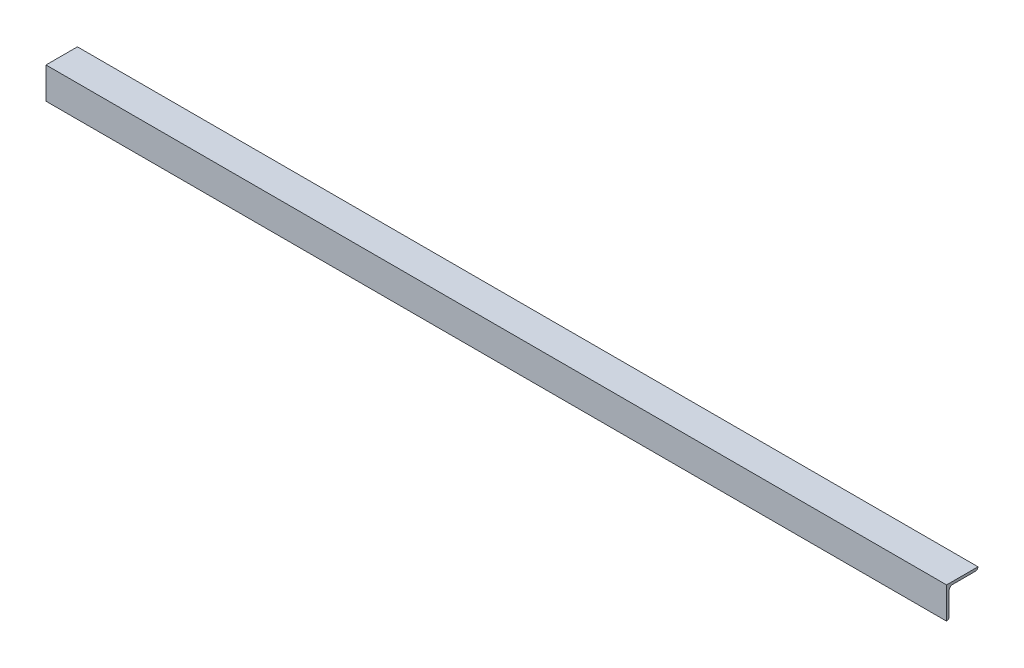
ISO-10303-21;
HEADER;
FILE_DESCRIPTION(('STEP AP214'),'2;1');
FILE_NAME('part.step','',(''),(''),'','','');
FILE_SCHEMA(('AUTOMOTIVE_DESIGN { 1 0 10303 214 1 1 1 1 }'));
ENDSEC;
DATA;
#1=APPLICATION_CONTEXT('core data for automotive mechanical design processes');
#2=APPLICATION_PROTOCOL_DEFINITION('international standard','automotive_design',2000,#1);
#3=PRODUCT_CONTEXT('',#1,'mechanical');
#4=PRODUCT('Part','Part','',(#3));
#5=PRODUCT_RELATED_PRODUCT_CATEGORY('part','',(#4));
#6=PRODUCT_DEFINITION_FORMATION('','',#4);
#7=PRODUCT_DEFINITION_CONTEXT('part definition',#1,'design');
#8=PRODUCT_DEFINITION('design','',#6,#7);
#9=PRODUCT_DEFINITION_SHAPE('','',#8);
#10=(LENGTH_UNIT() NAMED_UNIT(*) SI_UNIT(.MILLI.,.METRE.));
#11=(NAMED_UNIT(*) PLANE_ANGLE_UNIT() SI_UNIT($,.RADIAN.));
#12=(NAMED_UNIT(*) SI_UNIT($,.STERADIAN.) SOLID_ANGLE_UNIT());
#13=UNCERTAINTY_MEASURE_WITH_UNIT(LENGTH_MEASURE(1.E-05),#10,'distance_accuracy_value','');
#14=(GEOMETRIC_REPRESENTATION_CONTEXT(3) GLOBAL_UNCERTAINTY_ASSIGNED_CONTEXT((#13)) GLOBAL_UNIT_ASSIGNED_CONTEXT((#10,
#11,#12)) REPRESENTATION_CONTEXT('',''));
#15=CARTESIAN_POINT('',(0.,0.,0.));
#16=DIRECTION('',(0.,0.,1.));
#17=DIRECTION('',(1.,0.,0.));
#18=AXIS2_PLACEMENT_3D('',#15,#16,#17);
#19=CARTESIAN_POINT('',(-3939.78384,-14.2875,-14.2875));
#20=DIRECTION('',(1.,0.,0.));
#21=DIRECTION('',(0.,0.,-1.));
#22=AXIS2_PLACEMENT_3D('',#19,#20,#21);
#23=CYLINDRICAL_SURFACE('',#22,7.9375);
#24=DIRECTION('',(-1.,0.,0.));
#25=VECTOR('',#24,1.);
#26=CARTESIAN_POINT('',(-1092.2,-14.2875,-6.35));
#27=LINE('',#26,#25);
#28=CARTESIAN_POINT('',(-1092.2,-14.2875,-6.35));
#29=VERTEX_POINT('',#28);
#30=CARTESIAN_POINT('',(1092.2,-14.2875,-6.35));
#31=VERTEX_POINT('',#30);
#32=EDGE_CURVE('E83',#29,#31,#27,.F.);
#33=ORIENTED_EDGE('',*,*,#32,.F.);
#34=CARTESIAN_POINT('',(-1092.2,-14.2875,-14.2875));
#35=DIRECTION('',(1.,0.,0.));
#36=DIRECTION('',(0.,0.,-1.));
#37=AXIS2_PLACEMENT_3D('',#34,#35,#36);
#38=CIRCLE('',#37,7.9375);
#39=CARTESIAN_POINT('',(-1092.2,-6.35,-14.2875));
#40=VERTEX_POINT('',#39);
#41=EDGE_CURVE('E122',#29,#40,#38,.F.);
#42=ORIENTED_EDGE('',*,*,#41,.T.);
#43=DIRECTION('',(1.,0.,0.));
#44=VECTOR('',#43,1.);
#45=CARTESIAN_POINT('',(-1092.2,-6.35,-14.2875));
#46=LINE('',#45,#44);
#47=CARTESIAN_POINT('',(1092.2,-6.35,-14.2875));
#48=VERTEX_POINT('',#47);
#49=EDGE_CURVE('E84',#48,#40,#46,.F.);
#50=ORIENTED_EDGE('',*,*,#49,.F.);
#51=CARTESIAN_POINT('',(1092.2,-14.2875,-14.2875));
#52=DIRECTION('',(1.,0.,0.));
#53=DIRECTION('',(0.,0.,-1.));
#54=AXIS2_PLACEMENT_3D('',#51,#52,#53);
#55=CIRCLE('',#54,7.9375);
#56=EDGE_CURVE('E98',#31,#48,#55,.F.);
#57=ORIENTED_EDGE('',*,*,#56,.F.);
#58=EDGE_LOOP('',(#33,#42,#50,#57));
#59=FACE_BOUND('',#58,.T.);
#60=ADVANCED_FACE('F16',(#59),#23,.F.);
#61=CARTESIAN_POINT('',(-1092.2,-6.35,-6.35));
#62=DIRECTION('',(0.,-1.,0.));
#63=DIRECTION('',(0.,0.,-1.));
#64=AXIS2_PLACEMENT_3D('',#61,#62,#63);
#65=PLANE('',#64);
#66=DIRECTION('',(0.,0.,-1.));
#67=VECTOR('',#66,1.);
#68=CARTESIAN_POINT('',(1092.2,-6.35,0.));
#69=LINE('',#68,#67);
#70=CARTESIAN_POINT('',(1092.2,-6.35,-69.85));
#71=VERTEX_POINT('',#70);
#72=EDGE_CURVE('E77',#48,#71,#69,.T.);
#73=ORIENTED_EDGE('',*,*,#72,.F.);
#74=ORIENTED_EDGE('',*,*,#49,.T.);
#75=DIRECTION('',(0.,0.,-1.));
#76=VECTOR('',#75,1.);
#77=CARTESIAN_POINT('',(-1092.2,-6.35,0.));
#78=LINE('',#77,#76);
#79=CARTESIAN_POINT('',(-1092.2,-6.35,-69.85));
#80=VERTEX_POINT('',#79);
#81=EDGE_CURVE('E80',#40,#80,#78,.T.);
#82=ORIENTED_EDGE('',*,*,#81,.T.);
#83=DIRECTION('',(-1.,0.,0.));
#84=VECTOR('',#83,1.);
#85=CARTESIAN_POINT('',(3939.78384,-6.35,-69.85));
#86=LINE('',#85,#84);
#87=EDGE_CURVE('E72',#71,#80,#86,.T.);
#88=ORIENTED_EDGE('',*,*,#87,.F.);
#89=EDGE_LOOP('',(#73,#74,#82,#88));
#90=FACE_BOUND('',#89,.T.);
#91=ADVANCED_FACE('F74',(#90),#65,.T.);
#92=CARTESIAN_POINT('',(3939.78384,0.,-69.85));
#93=DIRECTION('',(-1.,0.,0.));
#94=DIRECTION('',(0.,0.,1.));
#95=AXIS2_PLACEMENT_3D('',#92,#93,#94);
#96=CYLINDRICAL_SURFACE('',#95,6.35);
#97=ORIENTED_EDGE('',*,*,#87,.T.);
#98=CARTESIAN_POINT('',(-1092.2,0.,-69.85));
#99=DIRECTION('',(-1.,0.,0.));
#100=DIRECTION('',(0.,0.,1.));
#101=AXIS2_PLACEMENT_3D('',#98,#99,#100);
#102=CIRCLE('',#101,6.35);
#103=CARTESIAN_POINT('',(-1092.2,0.,-76.2));
#104=VERTEX_POINT('',#103);
#105=EDGE_CURVE('E120',#80,#104,#102,.F.);
#106=ORIENTED_EDGE('',*,*,#105,.T.);
#107=DIRECTION('',(1.,0.,0.));
#108=VECTOR('',#107,1.);
#109=CARTESIAN_POINT('',(-1092.2,0.,-76.2));
#110=LINE('',#109,#108);
#111=CARTESIAN_POINT('',(1092.2,0.,-76.2));
#112=VERTEX_POINT('',#111);
#113=EDGE_CURVE('E90',#112,#104,#110,.F.);
#114=ORIENTED_EDGE('',*,*,#113,.F.);
#115=CARTESIAN_POINT('',(1092.2,0.,-69.85));
#116=DIRECTION('',(-1.,0.,0.));
#117=DIRECTION('',(0.,0.,1.));
#118=AXIS2_PLACEMENT_3D('',#115,#116,#117);
#119=CIRCLE('',#118,6.35);
#120=EDGE_CURVE('E19',#71,#112,#119,.F.);
#121=ORIENTED_EDGE('',*,*,#120,.F.);
#122=EDGE_LOOP('',(#97,#106,#114,#121));
#123=FACE_BOUND('',#122,.T.);
#124=ADVANCED_FACE('F88',(#123),#96,.T.);
#125=CARTESIAN_POINT('',(-1092.2,-76.2,-6.35));
#126=DIRECTION('',(0.,0.,-1.));
#127=DIRECTION('',(-1.,0.,0.));
#128=AXIS2_PLACEMENT_3D('',#125,#126,#127);
#129=PLANE('',#128);
#130=DIRECTION('',(0.,1.,0.));
#131=VECTOR('',#130,1.);
#132=CARTESIAN_POINT('',(-1092.2,0.,-6.35));
#133=LINE('',#132,#131);
#134=CARTESIAN_POINT('',(-1092.2,-69.85,-6.35));
#135=VERTEX_POINT('',#134);
#136=EDGE_CURVE('E112',#135,#29,#133,.T.);
#137=ORIENTED_EDGE('',*,*,#136,.T.);
#138=ORIENTED_EDGE('',*,*,#32,.T.);
#139=DIRECTION('',(0.,1.,0.));
#140=VECTOR('',#139,1.);
#141=CARTESIAN_POINT('',(1092.2,0.,-6.35));
#142=LINE('',#141,#140);
#143=CARTESIAN_POINT('',(1092.2,-69.85,-6.35));
#144=VERTEX_POINT('',#143);
#145=EDGE_CURVE('E94',#144,#31,#142,.T.);
#146=ORIENTED_EDGE('',*,*,#145,.F.);
#147=DIRECTION('',(-1.,0.,0.));
#148=VECTOR('',#147,1.);
#149=CARTESIAN_POINT('',(3939.78384,-69.85,-6.35));
#150=LINE('',#149,#148);
#151=EDGE_CURVE('E107',#135,#144,#150,.F.);
#152=ORIENTED_EDGE('',*,*,#151,.F.);
#153=EDGE_LOOP('',(#137,#138,#146,#152));
#154=FACE_BOUND('',#153,.T.);
#155=ADVANCED_FACE('F148',(#154),#129,.T.);
#156=CARTESIAN_POINT('',(1092.2,0.,0.));
#157=DIRECTION('',(1.,0.,0.));
#158=DIRECTION('',(0.,0.,-1.));
#159=AXIS2_PLACEMENT_3D('',#156,#157,#158);
#160=PLANE('',#159);
#161=ORIENTED_EDGE('',*,*,#56,.T.);
#162=ORIENTED_EDGE('',*,*,#72,.T.);
#163=ORIENTED_EDGE('',*,*,#120,.T.);
#164=DIRECTION('',(0.,0.,1.));
#165=VECTOR('',#164,1.);
#166=CARTESIAN_POINT('',(1092.2,0.,-76.2));
#167=LINE('',#166,#165);
#168=CARTESIAN_POINT('',(1092.2,0.,0.));
#169=VERTEX_POINT('',#168);
#170=EDGE_CURVE('E99',#169,#112,#167,.F.);
#171=ORIENTED_EDGE('',*,*,#170,.F.);
#172=DIRECTION('',(0.,1.,0.));
#173=VECTOR('',#172,1.);
#174=CARTESIAN_POINT('',(1092.2,0.,0.));
#175=LINE('',#174,#173);
#176=CARTESIAN_POINT('',(1092.2,-76.2,0.));
#177=VERTEX_POINT('',#176);
#178=EDGE_CURVE('E117',#177,#169,#175,.T.);
#179=ORIENTED_EDGE('',*,*,#178,.F.);
#180=CARTESIAN_POINT('',(1092.2,-69.85,0.));
#181=DIRECTION('',(-1.,0.,0.));
#182=DIRECTION('',(0.,0.,1.));
#183=AXIS2_PLACEMENT_3D('',#180,#181,#182);
#184=CIRCLE('',#183,6.35);
#185=EDGE_CURVE('E110',#144,#177,#184,.T.);
#186=ORIENTED_EDGE('',*,*,#185,.F.);
#187=ORIENTED_EDGE('',*,*,#145,.T.);
#188=EDGE_LOOP('',(#161,#162,#163,#171,#179,#186,#187));
#189=FACE_BOUND('',#188,.T.);
#190=ADVANCED_FACE('F95',(#189),#160,.T.);
#191=CARTESIAN_POINT('',(-1092.2,0.,-76.2));
#192=DIRECTION('',(0.,1.,0.));
#193=DIRECTION('',(0.,0.,1.));
#194=AXIS2_PLACEMENT_3D('',#191,#192,#193);
#195=PLANE('',#194);
#196=ORIENTED_EDGE('',*,*,#170,.T.);
#197=ORIENTED_EDGE('',*,*,#113,.T.);
#198=DIRECTION('',(0.,0.,-1.));
#199=VECTOR('',#198,1.);
#200=CARTESIAN_POINT('',(-1092.2,0.,0.));
#201=LINE('',#200,#199);
#202=CARTESIAN_POINT('',(-1092.2,0.,0.));
#203=VERTEX_POINT('',#202);
#204=EDGE_CURVE('E111',#104,#203,#201,.F.);
#205=ORIENTED_EDGE('',*,*,#204,.T.);
#206=DIRECTION('',(1.,0.,0.));
#207=VECTOR('',#206,1.);
#208=CARTESIAN_POINT('',(-1092.2,0.,0.));
#209=LINE('',#208,#207);
#210=EDGE_CURVE('E133',#169,#203,#209,.F.);
#211=ORIENTED_EDGE('',*,*,#210,.F.);
#212=EDGE_LOOP('',(#196,#197,#205,#211));
#213=FACE_BOUND('',#212,.T.);
#214=ADVANCED_FACE('F152',(#213),#195,.T.);
#215=CARTESIAN_POINT('',(-1092.2,0.,0.));
#216=DIRECTION('',(1.,0.,0.));
#217=DIRECTION('',(0.,0.,-1.));
#218=AXIS2_PLACEMENT_3D('',#215,#216,#217);
#219=PLANE('',#218);
#220=DIRECTION('',(0.,1.,0.));
#221=VECTOR('',#220,1.);
#222=CARTESIAN_POINT('',(-1092.2,0.,0.));
#223=LINE('',#222,#221);
#224=CARTESIAN_POINT('',(-1092.2,-76.2,0.));
#225=VERTEX_POINT('',#224);
#226=EDGE_CURVE('E25',#203,#225,#223,.F.);
#227=ORIENTED_EDGE('',*,*,#226,.F.);
#228=ORIENTED_EDGE('',*,*,#204,.F.);
#229=ORIENTED_EDGE('',*,*,#105,.F.);
#230=ORIENTED_EDGE('',*,*,#81,.F.);
#231=ORIENTED_EDGE('',*,*,#41,.F.);
#232=ORIENTED_EDGE('',*,*,#136,.F.);
#233=CARTESIAN_POINT('',(-1092.2,-69.85,0.));
#234=DIRECTION('',(-1.,0.,0.));
#235=DIRECTION('',(0.,0.,1.));
#236=AXIS2_PLACEMENT_3D('',#233,#234,#235);
#237=CIRCLE('',#236,6.35);
#238=EDGE_CURVE('E34',#225,#135,#237,.F.);
#239=ORIENTED_EDGE('',*,*,#238,.F.);
#240=EDGE_LOOP('',(#227,#228,#229,#230,#231,#232,#239));
#241=FACE_BOUND('',#240,.T.);
#242=ADVANCED_FACE('F149',(#241),#219,.F.);
#243=CARTESIAN_POINT('',(3939.78384,-69.85,0.));
#244=DIRECTION('',(-1.,0.,0.));
#245=DIRECTION('',(0.,0.,1.));
#246=AXIS2_PLACEMENT_3D('',#243,#244,#245);
#247=CYLINDRICAL_SURFACE('',#246,6.35);
#248=DIRECTION('',(1.,0.,0.));
#249=VECTOR('',#248,1.);
#250=CARTESIAN_POINT('',(-1092.2,-76.2,0.));
#251=LINE('',#250,#249);
#252=EDGE_CURVE('E11',#225,#177,#251,.T.);
#253=ORIENTED_EDGE('',*,*,#252,.F.);
#254=ORIENTED_EDGE('',*,*,#238,.T.);
#255=ORIENTED_EDGE('',*,*,#151,.T.);
#256=ORIENTED_EDGE('',*,*,#185,.T.);
#257=EDGE_LOOP('',(#253,#254,#255,#256));
#258=FACE_BOUND('',#257,.T.);
#259=ADVANCED_FACE('F147',(#258),#247,.T.);
#260=CARTESIAN_POINT('',(-1092.2,0.,0.));
#261=DIRECTION('',(0.,0.,1.));
#262=DIRECTION('',(1.,0.,0.));
#263=AXIS2_PLACEMENT_3D('',#260,#261,#262);
#264=PLANE('',#263);
#265=ORIENTED_EDGE('',*,*,#226,.T.);
#266=ORIENTED_EDGE('',*,*,#252,.T.);
#267=ORIENTED_EDGE('',*,*,#178,.T.);
#268=ORIENTED_EDGE('',*,*,#210,.T.);
#269=EDGE_LOOP('',(#265,#266,#267,#268));
#270=FACE_BOUND('',#269,.T.);
#271=ADVANCED_FACE('F143',(#270),#264,.T.);
#272=CLOSED_SHELL('',(#60,#91,#124,#155,#190,#214,#242,#259,#271));
#273=MANIFOLD_SOLID_BREP('B1',#272);
#274=ADVANCED_BREP_SHAPE_REPRESENTATION('',(#18,#273),#14);
#275=SHAPE_DEFINITION_REPRESENTATION(#9,#274);
ENDSEC;
END-ISO-10303-21;
